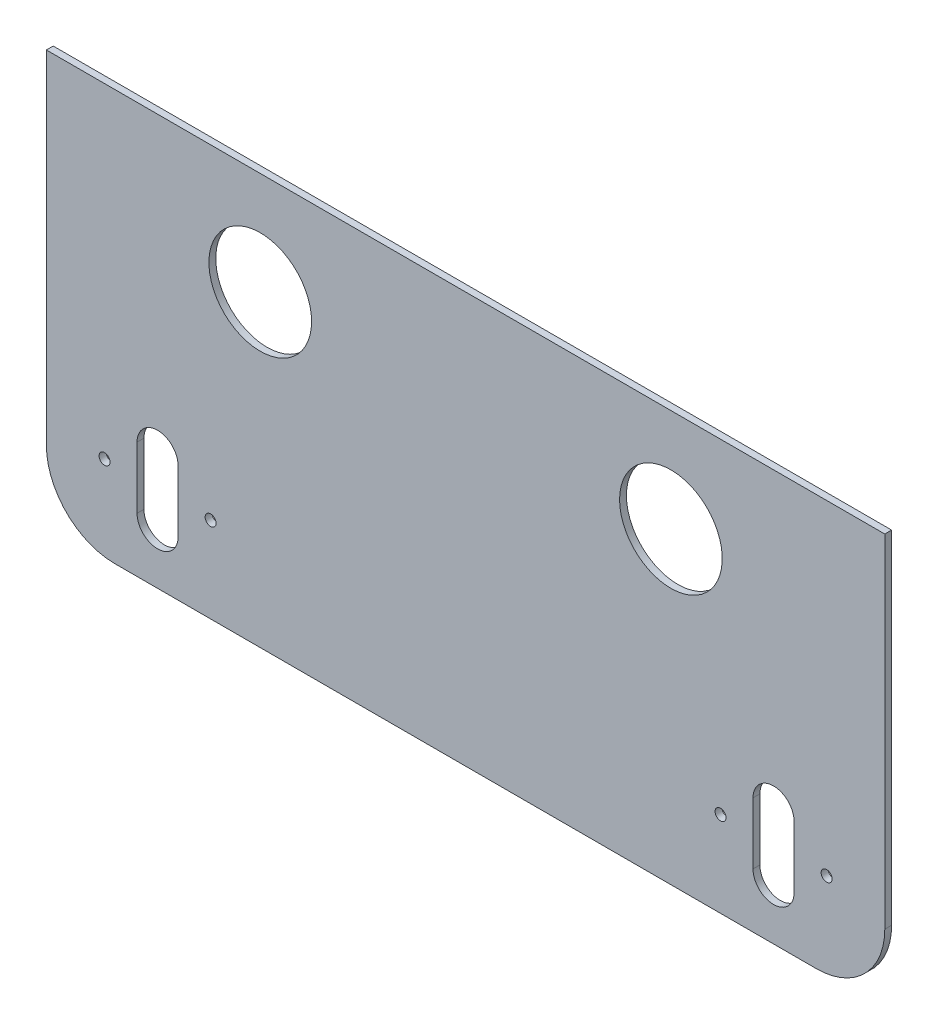
ISO-10303-21;
HEADER;
FILE_DESCRIPTION(('STEP AP214'),'2;1');
FILE_NAME('part.step','',(''),(''),'','','');
FILE_SCHEMA(('AUTOMOTIVE_DESIGN { 1 0 10303 214 1 1 1 1 }'));
ENDSEC;
DATA;
#1=APPLICATION_CONTEXT('core data for automotive mechanical design processes');
#2=APPLICATION_PROTOCOL_DEFINITION('international standard','automotive_design',2000,#1);
#3=PRODUCT_CONTEXT('',#1,'mechanical');
#4=PRODUCT('Part','Part','',(#3));
#5=PRODUCT_RELATED_PRODUCT_CATEGORY('part','',(#4));
#6=PRODUCT_DEFINITION_FORMATION('','',#4);
#7=PRODUCT_DEFINITION_CONTEXT('part definition',#1,'design');
#8=PRODUCT_DEFINITION('design','',#6,#7);
#9=PRODUCT_DEFINITION_SHAPE('','',#8);
#10=(LENGTH_UNIT() NAMED_UNIT(*) SI_UNIT(.MILLI.,.METRE.));
#11=(NAMED_UNIT(*) PLANE_ANGLE_UNIT() SI_UNIT($,.RADIAN.));
#12=(NAMED_UNIT(*) SI_UNIT($,.STERADIAN.) SOLID_ANGLE_UNIT());
#13=UNCERTAINTY_MEASURE_WITH_UNIT(LENGTH_MEASURE(1.E-05),#10,'distance_accuracy_value','');
#14=(GEOMETRIC_REPRESENTATION_CONTEXT(3) GLOBAL_UNCERTAINTY_ASSIGNED_CONTEXT((#13)) GLOBAL_UNIT_ASSIGNED_CONTEXT((#10,
#11,#12)) REPRESENTATION_CONTEXT('',''));
#15=CARTESIAN_POINT('',(0.,0.,0.));
#16=DIRECTION('',(0.,0.,1.));
#17=DIRECTION('',(1.,0.,0.));
#18=AXIS2_PLACEMENT_3D('',#15,#16,#17);
#19=CARTESIAN_POINT('',(0.,0.,2.));
#20=DIRECTION('',(0.,0.,1.));
#21=DIRECTION('',(1.,0.,0.));
#22=AXIS2_PLACEMENT_3D('',#19,#20,#21);
#23=PLANE('',#22);
#24=CARTESIAN_POINT('',(-41.7088974906264,-59.2936597760602,2.));
#25=DIRECTION('',(0.,0.,1.));
#26=DIRECTION('',(1.,0.,0.));
#27=AXIS2_PLACEMENT_3D('',#24,#25,#26);
#28=CIRCLE('',#27,5.99999999999997);
#29=CARTESIAN_POINT('',(-47.7088974906264,-59.2936597760602,2.));
#30=VERTEX_POINT('',#29);
#31=CARTESIAN_POINT('',(-35.7088974906264,-59.2936597760602,2.));
#32=VERTEX_POINT('',#31);
#33=EDGE_CURVE('E61',#30,#32,#28,.T.);
#34=ORIENTED_EDGE('',*,*,#33,.F.);
#35=DIRECTION('',(0.,-1.,0.));
#36=VECTOR('',#35,1.);
#37=CARTESIAN_POINT('',(-47.7088974906264,-59.2936597760602,2.));
#38=LINE('',#37,#36);
#39=CARTESIAN_POINT('',(-47.7088974906264,-41.2936597760602,2.));
#40=VERTEX_POINT('',#39);
#41=EDGE_CURVE('E190',#40,#30,#38,.T.);
#42=ORIENTED_EDGE('',*,*,#41,.F.);
#43=CARTESIAN_POINT('',(-41.7088974906264,-41.2936597760602,2.));
#44=DIRECTION('',(0.,0.,1.));
#45=DIRECTION('',(1.,0.,0.));
#46=AXIS2_PLACEMENT_3D('',#43,#44,#45);
#47=CIRCLE('',#46,5.99999999999997);
#48=CARTESIAN_POINT('',(-35.7088974906264,-41.2936597760602,2.));
#49=VERTEX_POINT('',#48);
#50=EDGE_CURVE('E199',#49,#40,#47,.T.);
#51=ORIENTED_EDGE('',*,*,#50,.F.);
#52=DIRECTION('',(0.,1.,0.));
#53=VECTOR('',#52,1.);
#54=CARTESIAN_POINT('',(-35.7088974906264,-59.2936597760602,2.));
#55=LINE('',#54,#53);
#56=EDGE_CURVE('E203',#32,#49,#55,.T.);
#57=ORIENTED_EDGE('',*,*,#56,.F.);
#58=EDGE_LOOP('',(#34,#42,#51,#57));
#59=FACE_BOUND('',#58,.T.);
#60=CARTESIAN_POINT('',(122.791102509374,-50.2936597760602,2.));
#61=DIRECTION('',(0.,0.,1.));
#62=DIRECTION('',(-1.,0.,0.));
#63=AXIS2_PLACEMENT_3D('',#60,#61,#62);
#64=CIRCLE('',#63,1.59999999999999);
#65=CARTESIAN_POINT('',(121.191102509374,-50.2936597760602,2.));
#66=VERTEX_POINT('',#65);
#67=EDGE_CURVE('E182',#66,#66,#64,.T.);
#68=ORIENTED_EDGE('',*,*,#67,.F.);
#69=EDGE_LOOP('',(#68));
#70=FACE_BOUND('',#69,.T.);
#71=CARTESIAN_POINT('',(153.791102509374,-50.2936597760602,2.));
#72=DIRECTION('',(0.,0.,1.));
#73=DIRECTION('',(-1.,0.,0.));
#74=AXIS2_PLACEMENT_3D('',#71,#72,#73);
#75=CIRCLE('',#74,1.59999999999999);
#76=CARTESIAN_POINT('',(152.191102509374,-50.2936597760602,2.));
#77=VERTEX_POINT('',#76);
#78=EDGE_CURVE('E186',#77,#77,#75,.T.);
#79=ORIENTED_EDGE('',*,*,#78,.F.);
#80=EDGE_LOOP('',(#79));
#81=FACE_BOUND('',#80,.T.);
#82=CARTESIAN_POINT('',(-57.2088974906264,-50.2936597760602,2.));
#83=DIRECTION('',(0.,0.,1.));
#84=DIRECTION('',(1.,0.,0.));
#85=AXIS2_PLACEMENT_3D('',#82,#83,#84);
#86=CIRCLE('',#85,1.60000000000001);
#87=CARTESIAN_POINT('',(-55.6088974906264,-50.2936597760602,2.));
#88=VERTEX_POINT('',#87);
#89=EDGE_CURVE('E209',#88,#88,#86,.T.);
#90=ORIENTED_EDGE('',*,*,#89,.F.);
#91=EDGE_LOOP('',(#90));
#92=FACE_BOUND('',#91,.T.);
#93=CARTESIAN_POINT('',(138.291102509374,-59.2936597760602,2.));
#94=DIRECTION('',(0.,0.,1.));
#95=DIRECTION('',(-1.,0.,0.));
#96=AXIS2_PLACEMENT_3D('',#93,#94,#95);
#97=CIRCLE('',#96,5.99999999999998);
#98=CARTESIAN_POINT('',(132.291102509374,-59.2936597760602,2.));
#99=VERTEX_POINT('',#98);
#100=CARTESIAN_POINT('',(144.291102509374,-59.2936597760602,2.));
#101=VERTEX_POINT('',#100);
#102=EDGE_CURVE('E69',#99,#101,#97,.T.);
#103=ORIENTED_EDGE('',*,*,#102,.F.);
#104=DIRECTION('',(0.,-1.,0.));
#105=VECTOR('',#104,1.);
#106=CARTESIAN_POINT('',(132.291102509374,-59.2936597760602,2.));
#107=LINE('',#106,#105);
#108=CARTESIAN_POINT('',(132.291102509374,-41.2936597760602,2.));
#109=VERTEX_POINT('',#108);
#110=EDGE_CURVE('E158',#109,#99,#107,.T.);
#111=ORIENTED_EDGE('',*,*,#110,.F.);
#112=CARTESIAN_POINT('',(138.291102509374,-41.2936597760602,2.));
#113=DIRECTION('',(0.,0.,1.));
#114=DIRECTION('',(-1.,0.,0.));
#115=AXIS2_PLACEMENT_3D('',#112,#113,#114);
#116=CIRCLE('',#115,5.99999999999998);
#117=CARTESIAN_POINT('',(144.291102509374,-41.2936597760602,2.));
#118=VERTEX_POINT('',#117);
#119=EDGE_CURVE('E165',#118,#109,#116,.T.);
#120=ORIENTED_EDGE('',*,*,#119,.F.);
#121=DIRECTION('',(0.,1.,0.));
#122=VECTOR('',#121,1.);
#123=CARTESIAN_POINT('',(144.291102509374,-59.2936597760602,2.));
#124=LINE('',#123,#122);
#125=EDGE_CURVE('E171',#101,#118,#124,.T.);
#126=ORIENTED_EDGE('',*,*,#125,.F.);
#127=EDGE_LOOP('',(#103,#111,#120,#126));
#128=FACE_BOUND('',#127,.T.);
#129=CARTESIAN_POINT('',(-26.2088974906264,-50.2936597760602,2.));
#130=DIRECTION('',(0.,0.,1.));
#131=DIRECTION('',(1.,0.,0.));
#132=AXIS2_PLACEMENT_3D('',#129,#130,#131);
#133=CIRCLE('',#132,1.6);
#134=CARTESIAN_POINT('',(-24.6088974906264,-50.2936597760602,2.));
#135=VERTEX_POINT('',#134);
#136=EDGE_CURVE('E213',#135,#135,#133,.T.);
#137=ORIENTED_EDGE('',*,*,#136,.F.);
#138=EDGE_LOOP('',(#137));
#139=FACE_BOUND('',#138,.T.);
#140=CARTESIAN_POINT('',(-11.7088974906264,14.7063402239398,2.));
#141=DIRECTION('',(0.,0.,1.));
#142=DIRECTION('',(1.,0.,0.));
#143=AXIS2_PLACEMENT_3D('',#140,#141,#142);
#144=CIRCLE('',#143,15.);
#145=CARTESIAN_POINT('',(3.29110250937359,14.7063402239398,2.));
#146=VERTEX_POINT('',#145);
#147=EDGE_CURVE('E231',#146,#146,#144,.T.);
#148=ORIENTED_EDGE('',*,*,#147,.F.);
#149=EDGE_LOOP('',(#148));
#150=FACE_BOUND('',#149,.T.);
#151=DIRECTION('',(0.,-1.,0.));
#152=VECTOR('',#151,1.);
#153=CARTESIAN_POINT('',(-74.2088974906264,44.7063402239398,2.));
#154=LINE('',#153,#152);
#155=CARTESIAN_POINT('',(-74.2088974906264,44.7063402239398,2.));
#156=VERTEX_POINT('',#155);
#157=CARTESIAN_POINT('',(-74.2088974906264,-55.2936597760602,2.));
#158=VERTEX_POINT('',#157);
#159=EDGE_CURVE('E239',#156,#158,#154,.T.);
#160=ORIENTED_EDGE('',*,*,#159,.T.);
#161=CARTESIAN_POINT('',(-54.2088974906264,-55.2936597760602,2.));
#162=DIRECTION('',(0.,0.,1.));
#163=DIRECTION('',(1.,0.,0.));
#164=AXIS2_PLACEMENT_3D('',#161,#162,#163);
#165=CIRCLE('',#164,20.);
#166=CARTESIAN_POINT('',(-54.2088974906264,-75.2936597760602,2.));
#167=VERTEX_POINT('',#166);
#168=EDGE_CURVE('E297',#158,#167,#165,.T.);
#169=ORIENTED_EDGE('',*,*,#168,.T.);
#170=DIRECTION('',(1.,0.,0.));
#171=VECTOR('',#170,1.);
#172=CARTESIAN_POINT('',(-74.2088974906264,-75.2936597760602,2.));
#173=LINE('',#172,#171);
#174=CARTESIAN_POINT('',(150.791102509374,-75.2936597760602,2.));
#175=VERTEX_POINT('',#174);
#176=EDGE_CURVE('E243',#167,#175,#173,.T.);
#177=ORIENTED_EDGE('',*,*,#176,.T.);
#178=CARTESIAN_POINT('',(150.791102509374,-55.2936597760602,2.));
#179=DIRECTION('',(0.,0.,1.));
#180=DIRECTION('',(1.,0.,0.));
#181=AXIS2_PLACEMENT_3D('',#178,#179,#180);
#182=CIRCLE('',#181,20.);
#183=CARTESIAN_POINT('',(170.791102509374,-55.2936597760602,2.));
#184=VERTEX_POINT('',#183);
#185=EDGE_CURVE('E284',#175,#184,#182,.T.);
#186=ORIENTED_EDGE('',*,*,#185,.T.);
#187=DIRECTION('',(0.,1.,0.));
#188=VECTOR('',#187,1.);
#189=CARTESIAN_POINT('',(170.791102509374,44.7063402239398,2.));
#190=LINE('',#189,#188);
#191=CARTESIAN_POINT('',(170.791102509374,44.7063402239398,2.));
#192=VERTEX_POINT('',#191);
#193=EDGE_CURVE('E247',#184,#192,#190,.T.);
#194=ORIENTED_EDGE('',*,*,#193,.T.);
#195=DIRECTION('',(-1.,0.,0.));
#196=VECTOR('',#195,1.);
#197=CARTESIAN_POINT('',(-74.2088974906264,44.7063402239398,2.));
#198=LINE('',#197,#196);
#199=EDGE_CURVE('E250',#192,#156,#198,.T.);
#200=ORIENTED_EDGE('',*,*,#199,.T.);
#201=EDGE_LOOP('',(#160,#169,#177,#186,#194,#200));
#202=FACE_BOUND('',#201,.T.);
#203=CARTESIAN_POINT('',(108.291102509374,14.7063402239398,2.));
#204=DIRECTION('',(0.,0.,1.));
#205=DIRECTION('',(-1.,0.,0.));
#206=AXIS2_PLACEMENT_3D('',#203,#204,#205);
#207=CIRCLE('',#206,15.);
#208=CARTESIAN_POINT('',(93.2911025093736,14.7063402239398,2.));
#209=VERTEX_POINT('',#208);
#210=EDGE_CURVE('E221',#209,#209,#207,.T.);
#211=ORIENTED_EDGE('',*,*,#210,.F.);
#212=EDGE_LOOP('',(#211));
#213=FACE_BOUND('',#212,.T.);
#214=ADVANCED_FACE('F45',(#59,#70,#81,#92,#128,#139,#150,#202,#213),#23,.T.);
#215=CARTESIAN_POINT('',(0.,0.,0.));
#216=DIRECTION('',(0.,0.,1.));
#217=DIRECTION('',(1.,0.,0.));
#218=AXIS2_PLACEMENT_3D('',#215,#216,#217);
#219=PLANE('',#218);
#220=DIRECTION('',(0.,-1.,0.));
#221=VECTOR('',#220,1.);
#222=CARTESIAN_POINT('',(-47.7088974906264,0.,0.));
#223=LINE('',#222,#221);
#224=CARTESIAN_POINT('',(-47.7088974906264,-41.2936597760602,0.));
#225=VERTEX_POINT('',#224);
#226=CARTESIAN_POINT('',(-47.7088974906264,-59.2936597760602,0.));
#227=VERTEX_POINT('',#226);
#228=EDGE_CURVE('E54',#225,#227,#223,.T.);
#229=ORIENTED_EDGE('',*,*,#228,.T.);
#230=CARTESIAN_POINT('',(-41.7088974906264,-59.2936597760602,0.));
#231=DIRECTION('',(0.,0.,1.));
#232=DIRECTION('',(1.,0.,0.));
#233=AXIS2_PLACEMENT_3D('',#230,#231,#232);
#234=CIRCLE('',#233,5.99999999999997);
#235=CARTESIAN_POINT('',(-35.7088974906264,-59.2936597760602,0.));
#236=VERTEX_POINT('',#235);
#237=EDGE_CURVE('E11',#227,#236,#234,.T.);
#238=ORIENTED_EDGE('',*,*,#237,.T.);
#239=DIRECTION('',(0.,1.,0.));
#240=VECTOR('',#239,1.);
#241=CARTESIAN_POINT('',(-35.7088974906264,0.,0.));
#242=LINE('',#241,#240);
#243=CARTESIAN_POINT('',(-35.7088974906264,-41.2936597760602,0.));
#244=VERTEX_POINT('',#243);
#245=EDGE_CURVE('E317',#236,#244,#242,.T.);
#246=ORIENTED_EDGE('',*,*,#245,.T.);
#247=CARTESIAN_POINT('',(-41.7088974906264,-41.2936597760602,0.));
#248=DIRECTION('',(0.,0.,1.));
#249=DIRECTION('',(1.,0.,0.));
#250=AXIS2_PLACEMENT_3D('',#247,#248,#249);
#251=CIRCLE('',#250,5.99999999999997);
#252=EDGE_CURVE('E331',#244,#225,#251,.T.);
#253=ORIENTED_EDGE('',*,*,#252,.T.);
#254=EDGE_LOOP('',(#229,#238,#246,#253));
#255=FACE_BOUND('',#254,.T.);
#256=CARTESIAN_POINT('',(122.791102509374,-50.2936597760602,0.));
#257=DIRECTION('',(0.,0.,1.));
#258=DIRECTION('',(1.,0.,0.));
#259=AXIS2_PLACEMENT_3D('',#256,#257,#258);
#260=CIRCLE('',#259,1.59999999999999);
#261=CARTESIAN_POINT('',(124.391102509374,-50.2936597760602,0.));
#262=VERTEX_POINT('',#261);
#263=EDGE_CURVE('E230',#262,#262,#260,.T.);
#264=ORIENTED_EDGE('',*,*,#263,.T.);
#265=EDGE_LOOP('',(#264));
#266=FACE_BOUND('',#265,.T.);
#267=CARTESIAN_POINT('',(153.791102509374,-50.2936597760602,0.));
#268=DIRECTION('',(0.,0.,1.));
#269=DIRECTION('',(1.,0.,0.));
#270=AXIS2_PLACEMENT_3D('',#267,#268,#269);
#271=CIRCLE('',#270,1.59999999999999);
#272=CARTESIAN_POINT('',(155.391102509374,-50.2936597760602,0.));
#273=VERTEX_POINT('',#272);
#274=EDGE_CURVE('E321',#273,#273,#271,.T.);
#275=ORIENTED_EDGE('',*,*,#274,.T.);
#276=EDGE_LOOP('',(#275));
#277=FACE_BOUND('',#276,.T.);
#278=CARTESIAN_POINT('',(-57.2088974906264,-50.2936597760602,0.));
#279=DIRECTION('',(0.,0.,1.));
#280=DIRECTION('',(1.,0.,0.));
#281=AXIS2_PLACEMENT_3D('',#278,#279,#280);
#282=CIRCLE('',#281,1.60000000000001);
#283=CARTESIAN_POINT('',(-55.6088974906264,-50.2936597760602,0.));
#284=VERTEX_POINT('',#283);
#285=EDGE_CURVE('E304',#284,#284,#282,.T.);
#286=ORIENTED_EDGE('',*,*,#285,.T.);
#287=EDGE_LOOP('',(#286));
#288=FACE_BOUND('',#287,.T.);
#289=DIRECTION('',(0.,-1.,0.));
#290=VECTOR('',#289,1.);
#291=CARTESIAN_POINT('',(132.291102509374,0.,0.));
#292=LINE('',#291,#290);
#293=CARTESIAN_POINT('',(132.291102509374,-41.2936597760602,0.));
#294=VERTEX_POINT('',#293);
#295=CARTESIAN_POINT('',(132.291102509374,-59.2936597760602,0.));
#296=VERTEX_POINT('',#295);
#297=EDGE_CURVE('E312',#294,#296,#292,.T.);
#298=ORIENTED_EDGE('',*,*,#297,.T.);
#299=CARTESIAN_POINT('',(138.291102509374,-59.2936597760602,0.));
#300=DIRECTION('',(0.,0.,1.));
#301=DIRECTION('',(1.,0.,0.));
#302=AXIS2_PLACEMENT_3D('',#299,#300,#301);
#303=CIRCLE('',#302,5.99999999999998);
#304=CARTESIAN_POINT('',(144.291102509374,-59.2936597760602,0.));
#305=VERTEX_POINT('',#304);
#306=EDGE_CURVE('E151',#296,#305,#303,.T.);
#307=ORIENTED_EDGE('',*,*,#306,.T.);
#308=DIRECTION('',(0.,1.,0.));
#309=VECTOR('',#308,1.);
#310=CARTESIAN_POINT('',(144.291102509374,0.,0.));
#311=LINE('',#310,#309);
#312=CARTESIAN_POINT('',(144.291102509374,-41.2936597760602,0.));
#313=VERTEX_POINT('',#312);
#314=EDGE_CURVE('E300',#305,#313,#311,.T.);
#315=ORIENTED_EDGE('',*,*,#314,.T.);
#316=CARTESIAN_POINT('',(138.291102509374,-41.2936597760602,0.));
#317=DIRECTION('',(0.,0.,1.));
#318=DIRECTION('',(1.,0.,0.));
#319=AXIS2_PLACEMENT_3D('',#316,#317,#318);
#320=CIRCLE('',#319,5.99999999999998);
#321=EDGE_CURVE('E308',#313,#294,#320,.T.);
#322=ORIENTED_EDGE('',*,*,#321,.T.);
#323=EDGE_LOOP('',(#298,#307,#315,#322));
#324=FACE_BOUND('',#323,.T.);
#325=CARTESIAN_POINT('',(-26.2088974906264,-50.2936597760602,0.));
#326=DIRECTION('',(0.,0.,1.));
#327=DIRECTION('',(1.,0.,0.));
#328=AXIS2_PLACEMENT_3D('',#325,#326,#327);
#329=CIRCLE('',#328,1.6);
#330=CARTESIAN_POINT('',(-24.6088974906264,-50.2936597760602,0.));
#331=VERTEX_POINT('',#330);
#332=EDGE_CURVE('E220',#331,#331,#329,.T.);
#333=ORIENTED_EDGE('',*,*,#332,.T.);
#334=EDGE_LOOP('',(#333));
#335=FACE_BOUND('',#334,.T.);
#336=DIRECTION('',(1.,0.,0.));
#337=VECTOR('',#336,1.);
#338=CARTESIAN_POINT('',(-74.2088974906264,-75.2936597760602,0.));
#339=LINE('',#338,#337);
#340=CARTESIAN_POINT('',(-54.2088974906264,-75.2936597760602,0.));
#341=VERTEX_POINT('',#340);
#342=CARTESIAN_POINT('',(150.791102509374,-75.2936597760602,0.));
#343=VERTEX_POINT('',#342);
#344=EDGE_CURVE('E257',#341,#343,#339,.T.);
#345=ORIENTED_EDGE('',*,*,#344,.F.);
#346=CARTESIAN_POINT('',(-54.2088974906264,-55.2936597760602,0.));
#347=DIRECTION('',(0.,0.,1.));
#348=DIRECTION('',(1.,0.,0.));
#349=AXIS2_PLACEMENT_3D('',#346,#347,#348);
#350=CIRCLE('',#349,20.);
#351=CARTESIAN_POINT('',(-74.2088974906264,-55.2936597760602,0.));
#352=VERTEX_POINT('',#351);
#353=EDGE_CURVE('E291',#341,#352,#350,.F.);
#354=ORIENTED_EDGE('',*,*,#353,.T.);
#355=DIRECTION('',(0.,-1.,0.));
#356=VECTOR('',#355,1.);
#357=CARTESIAN_POINT('',(-74.2088974906264,44.7063402239398,0.));
#358=LINE('',#357,#356);
#359=CARTESIAN_POINT('',(-74.2088974906264,44.7063402239398,0.));
#360=VERTEX_POINT('',#359);
#361=EDGE_CURVE('E235',#360,#352,#358,.T.);
#362=ORIENTED_EDGE('',*,*,#361,.F.);
#363=DIRECTION('',(-1.,0.,0.));
#364=VECTOR('',#363,1.);
#365=CARTESIAN_POINT('',(-74.2088974906264,44.7063402239398,0.));
#366=LINE('',#365,#364);
#367=CARTESIAN_POINT('',(170.791102509374,44.7063402239398,0.));
#368=VERTEX_POINT('',#367);
#369=EDGE_CURVE('E244',#368,#360,#366,.T.);
#370=ORIENTED_EDGE('',*,*,#369,.F.);
#371=DIRECTION('',(0.,1.,0.));
#372=VECTOR('',#371,1.);
#373=CARTESIAN_POINT('',(170.791102509374,44.7063402239398,0.));
#374=LINE('',#373,#372);
#375=CARTESIAN_POINT('',(170.791102509374,-55.2936597760602,0.));
#376=VERTEX_POINT('',#375);
#377=EDGE_CURVE('E260',#376,#368,#374,.T.);
#378=ORIENTED_EDGE('',*,*,#377,.F.);
#379=CARTESIAN_POINT('',(150.791102509374,-55.2936597760602,0.));
#380=DIRECTION('',(0.,0.,1.));
#381=DIRECTION('',(1.,0.,0.));
#382=AXIS2_PLACEMENT_3D('',#379,#380,#381);
#383=CIRCLE('',#382,20.);
#384=EDGE_CURVE('E276',#376,#343,#383,.F.);
#385=ORIENTED_EDGE('',*,*,#384,.T.);
#386=EDGE_LOOP('',(#345,#354,#362,#370,#378,#385));
#387=FACE_BOUND('',#386,.T.);
#388=CARTESIAN_POINT('',(-11.7088974906264,14.7063402239398,0.));
#389=DIRECTION('',(0.,0.,1.));
#390=DIRECTION('',(1.,0.,0.));
#391=AXIS2_PLACEMENT_3D('',#388,#389,#390);
#392=CIRCLE('',#391,15.);
#393=CARTESIAN_POINT('',(3.29110250937359,14.7063402239398,0.));
#394=VERTEX_POINT('',#393);
#395=EDGE_CURVE('E225',#394,#394,#392,.T.);
#396=ORIENTED_EDGE('',*,*,#395,.T.);
#397=EDGE_LOOP('',(#396));
#398=FACE_BOUND('',#397,.T.);
#399=CARTESIAN_POINT('',(108.291102509374,14.7063402239398,0.));
#400=DIRECTION('',(0.,0.,1.));
#401=DIRECTION('',(-1.,0.,0.));
#402=AXIS2_PLACEMENT_3D('',#399,#400,#401);
#403=CIRCLE('',#402,15.);
#404=CARTESIAN_POINT('',(93.2911025093736,14.7063402239398,0.));
#405=VERTEX_POINT('',#404);
#406=EDGE_CURVE('E226',#405,#405,#403,.T.);
#407=ORIENTED_EDGE('',*,*,#406,.T.);
#408=EDGE_LOOP('',(#407));
#409=FACE_BOUND('',#408,.T.);
#410=ADVANCED_FACE('F337',(#255,#266,#277,#288,#324,#335,#387,#398,#409),#219,.F.);
#411=CARTESIAN_POINT('',(-74.2088974906264,44.7063402239398,2.));
#412=DIRECTION('',(1.,0.,0.));
#413=DIRECTION('',(0.,1.,0.));
#414=AXIS2_PLACEMENT_3D('',#411,#412,#413);
#415=PLANE('',#414);
#416=ORIENTED_EDGE('',*,*,#361,.T.);
#417=DIRECTION('',(0.,0.,-1.));
#418=VECTOR('',#417,1.);
#419=CARTESIAN_POINT('',(-74.2088974906264,-55.2936597760602,2.));
#420=LINE('',#419,#418);
#421=EDGE_CURVE('E294',#352,#158,#420,.F.);
#422=ORIENTED_EDGE('',*,*,#421,.T.);
#423=ORIENTED_EDGE('',*,*,#159,.F.);
#424=DIRECTION('',(0.,0.,-1.));
#425=VECTOR('',#424,1.);
#426=CARTESIAN_POINT('',(-74.2088974906264,44.7063402239398,2.));
#427=LINE('',#426,#425);
#428=EDGE_CURVE('E253',#156,#360,#427,.T.);
#429=ORIENTED_EDGE('',*,*,#428,.T.);
#430=EDGE_LOOP('',(#416,#422,#423,#429));
#431=FACE_BOUND('',#430,.T.);
#432=ADVANCED_FACE('F372',(#431),#415,.F.);
#433=CARTESIAN_POINT('',(-74.2088974906264,-75.2936597760602,2.));
#434=DIRECTION('',(0.,1.,0.));
#435=DIRECTION('',(-1.,0.,0.));
#436=AXIS2_PLACEMENT_3D('',#433,#434,#435);
#437=PLANE('',#436);
#438=ORIENTED_EDGE('',*,*,#176,.F.);
#439=DIRECTION('',(0.,0.,-1.));
#440=VECTOR('',#439,1.);
#441=CARTESIAN_POINT('',(-54.2088974906264,-75.2936597760602,2.));
#442=LINE('',#441,#440);
#443=EDGE_CURVE('E287',#167,#341,#442,.T.);
#444=ORIENTED_EDGE('',*,*,#443,.T.);
#445=ORIENTED_EDGE('',*,*,#344,.T.);
#446=DIRECTION('',(0.,0.,-1.));
#447=VECTOR('',#446,1.);
#448=CARTESIAN_POINT('',(150.791102509374,-75.2936597760602,2.));
#449=LINE('',#448,#447);
#450=EDGE_CURVE('E280',#343,#175,#449,.F.);
#451=ORIENTED_EDGE('',*,*,#450,.T.);
#452=EDGE_LOOP('',(#438,#444,#445,#451));
#453=FACE_BOUND('',#452,.T.);
#454=ADVANCED_FACE('F385',(#453),#437,.F.);
#455=CARTESIAN_POINT('',(170.791102509374,44.7063402239398,2.));
#456=DIRECTION('',(-1.,0.,0.));
#457=DIRECTION('',(0.,-1.,0.));
#458=AXIS2_PLACEMENT_3D('',#455,#456,#457);
#459=PLANE('',#458);
#460=ORIENTED_EDGE('',*,*,#193,.F.);
#461=DIRECTION('',(0.,0.,-1.));
#462=VECTOR('',#461,1.);
#463=CARTESIAN_POINT('',(170.791102509374,-55.2936597760602,2.));
#464=LINE('',#463,#462);
#465=EDGE_CURVE('E272',#184,#376,#464,.T.);
#466=ORIENTED_EDGE('',*,*,#465,.T.);
#467=ORIENTED_EDGE('',*,*,#377,.T.);
#468=DIRECTION('',(0.,0.,-1.));
#469=VECTOR('',#468,1.);
#470=CARTESIAN_POINT('',(170.791102509374,44.7063402239398,2.));
#471=LINE('',#470,#469);
#472=EDGE_CURVE('E268',#192,#368,#471,.T.);
#473=ORIENTED_EDGE('',*,*,#472,.F.);
#474=EDGE_LOOP('',(#460,#466,#467,#473));
#475=FACE_BOUND('',#474,.T.);
#476=ADVANCED_FACE('F381',(#475),#459,.F.);
#477=CARTESIAN_POINT('',(-74.2088974906264,44.7063402239398,2.));
#478=DIRECTION('',(0.,-1.,0.));
#479=DIRECTION('',(1.,0.,0.));
#480=AXIS2_PLACEMENT_3D('',#477,#478,#479);
#481=PLANE('',#480);
#482=ORIENTED_EDGE('',*,*,#369,.T.);
#483=ORIENTED_EDGE('',*,*,#428,.F.);
#484=ORIENTED_EDGE('',*,*,#199,.F.);
#485=ORIENTED_EDGE('',*,*,#472,.T.);
#486=EDGE_LOOP('',(#482,#483,#484,#485));
#487=FACE_BOUND('',#486,.T.);
#488=ADVANCED_FACE('F378',(#487),#481,.F.);
#489=CARTESIAN_POINT('',(-11.7088974906264,14.7063402239398,2.));
#490=DIRECTION('',(0.,0.,-1.));
#491=DIRECTION('',(-1.,0.,0.));
#492=AXIS2_PLACEMENT_3D('',#489,#490,#491);
#493=CYLINDRICAL_SURFACE('',#492,15.);
#494=ORIENTED_EDGE('',*,*,#147,.T.);
#495=EDGE_LOOP('',(#494));
#496=FACE_BOUND('',#495,.T.);
#497=ORIENTED_EDGE('',*,*,#395,.F.);
#498=EDGE_LOOP('',(#497));
#499=FACE_BOUND('',#498,.T.);
#500=ADVANCED_FACE('F375',(#496,#499),#493,.F.);
#501=CARTESIAN_POINT('',(108.291102509374,14.7063402239398,2.));
#502=DIRECTION('',(0.,0.,-1.));
#503=DIRECTION('',(-1.,0.,0.));
#504=AXIS2_PLACEMENT_3D('',#501,#502,#503);
#505=CYLINDRICAL_SURFACE('',#504,15.);
#506=ORIENTED_EDGE('',*,*,#210,.T.);
#507=EDGE_LOOP('',(#506));
#508=FACE_BOUND('',#507,.T.);
#509=ORIENTED_EDGE('',*,*,#406,.F.);
#510=EDGE_LOOP('',(#509));
#511=FACE_BOUND('',#510,.T.);
#512=ADVANCED_FACE('F394',(#508,#511),#505,.F.);
#513=CARTESIAN_POINT('',(150.791102509374,-55.2936597760602,2.));
#514=DIRECTION('',(0.,0.,-1.));
#515=DIRECTION('',(-1.,0.,0.));
#516=AXIS2_PLACEMENT_3D('',#513,#514,#515);
#517=CYLINDRICAL_SURFACE('',#516,20.);
#518=ORIENTED_EDGE('',*,*,#185,.F.);
#519=ORIENTED_EDGE('',*,*,#450,.F.);
#520=ORIENTED_EDGE('',*,*,#384,.F.);
#521=ORIENTED_EDGE('',*,*,#465,.F.);
#522=EDGE_LOOP('',(#518,#519,#520,#521));
#523=FACE_BOUND('',#522,.T.);
#524=ADVANCED_FACE('F392',(#523),#517,.T.);
#525=CARTESIAN_POINT('',(-54.2088974906264,-55.2936597760602,2.));
#526=DIRECTION('',(0.,0.,-1.));
#527=DIRECTION('',(-1.,0.,0.));
#528=AXIS2_PLACEMENT_3D('',#525,#526,#527);
#529=CYLINDRICAL_SURFACE('',#528,20.);
#530=ORIENTED_EDGE('',*,*,#168,.F.);
#531=ORIENTED_EDGE('',*,*,#421,.F.);
#532=ORIENTED_EDGE('',*,*,#353,.F.);
#533=ORIENTED_EDGE('',*,*,#443,.F.);
#534=EDGE_LOOP('',(#530,#531,#532,#533));
#535=FACE_BOUND('',#534,.T.);
#536=ADVANCED_FACE('F47',(#535),#529,.T.);
#537=CARTESIAN_POINT('',(-26.2088974906264,-50.2936597760602,-8.));
#538=DIRECTION('',(0.,0.,1.));
#539=DIRECTION('',(1.,0.,0.));
#540=AXIS2_PLACEMENT_3D('',#537,#538,#539);
#541=CYLINDRICAL_SURFACE('',#540,1.6);
#542=ORIENTED_EDGE('',*,*,#136,.T.);
#543=EDGE_LOOP('',(#542));
#544=FACE_BOUND('',#543,.T.);
#545=ORIENTED_EDGE('',*,*,#332,.F.);
#546=EDGE_LOOP('',(#545));
#547=FACE_BOUND('',#546,.T.);
#548=ADVANCED_FACE('F398',(#544,#547),#541,.F.);
#549=CARTESIAN_POINT('',(138.291102509374,-59.2936597760602,-8.));
#550=DIRECTION('',(0.,0.,1.));
#551=DIRECTION('',(1.,0.,0.));
#552=AXIS2_PLACEMENT_3D('',#549,#550,#551);
#553=CYLINDRICAL_SURFACE('',#552,5.99999999999998);
#554=DIRECTION('',(0.,0.,1.));
#555=VECTOR('',#554,1.);
#556=CARTESIAN_POINT('',(132.291102509374,-59.2936597760602,-8.));
#557=LINE('',#556,#555);
#558=EDGE_CURVE('E147',#296,#99,#557,.T.);
#559=ORIENTED_EDGE('',*,*,#558,.T.);
#560=ORIENTED_EDGE('',*,*,#102,.T.);
#561=DIRECTION('',(0.,0.,1.));
#562=VECTOR('',#561,1.);
#563=CARTESIAN_POINT('',(144.291102509374,-59.2936597760602,-8.));
#564=LINE('',#563,#562);
#565=EDGE_CURVE('E166',#305,#101,#564,.T.);
#566=ORIENTED_EDGE('',*,*,#565,.F.);
#567=ORIENTED_EDGE('',*,*,#306,.F.);
#568=EDGE_LOOP('',(#559,#560,#566,#567));
#569=FACE_BOUND('',#568,.T.);
#570=ADVANCED_FACE('F149',(#569),#553,.F.);
#571=CARTESIAN_POINT('',(132.291102509374,-59.2936597760602,-8.));
#572=DIRECTION('',(-1.,0.,0.));
#573=DIRECTION('',(0.,0.,1.));
#574=AXIS2_PLACEMENT_3D('',#571,#572,#573);
#575=PLANE('',#574);
#576=DIRECTION('',(0.,0.,1.));
#577=VECTOR('',#576,1.);
#578=CARTESIAN_POINT('',(132.291102509374,-41.2936597760602,-8.));
#579=LINE('',#578,#577);
#580=EDGE_CURVE('E155',#294,#109,#579,.T.);
#581=ORIENTED_EDGE('',*,*,#580,.T.);
#582=ORIENTED_EDGE('',*,*,#110,.T.);
#583=ORIENTED_EDGE('',*,*,#558,.F.);
#584=ORIENTED_EDGE('',*,*,#297,.F.);
#585=EDGE_LOOP('',(#581,#582,#583,#584));
#586=FACE_BOUND('',#585,.T.);
#587=ADVANCED_FACE('F159',(#586),#575,.F.);
#588=CARTESIAN_POINT('',(138.291102509374,-41.2936597760602,-8.));
#589=DIRECTION('',(0.,0.,1.));
#590=DIRECTION('',(1.,0.,0.));
#591=AXIS2_PLACEMENT_3D('',#588,#589,#590);
#592=CYLINDRICAL_SURFACE('',#591,5.99999999999998);
#593=DIRECTION('',(0.,0.,1.));
#594=VECTOR('',#593,1.);
#595=CARTESIAN_POINT('',(144.291102509374,-41.2936597760602,-8.));
#596=LINE('',#595,#594);
#597=EDGE_CURVE('E594',#313,#118,#596,.T.);
#598=ORIENTED_EDGE('',*,*,#597,.T.);
#599=ORIENTED_EDGE('',*,*,#119,.T.);
#600=ORIENTED_EDGE('',*,*,#580,.F.);
#601=ORIENTED_EDGE('',*,*,#321,.F.);
#602=EDGE_LOOP('',(#598,#599,#600,#601));
#603=FACE_BOUND('',#602,.T.);
#604=ADVANCED_FACE('F489',(#603),#592,.F.);
#605=CARTESIAN_POINT('',(144.291102509374,-59.2936597760602,-8.));
#606=DIRECTION('',(1.,0.,0.));
#607=DIRECTION('',(0.,0.,-1.));
#608=AXIS2_PLACEMENT_3D('',#605,#606,#607);
#609=PLANE('',#608);
#610=ORIENTED_EDGE('',*,*,#565,.T.);
#611=ORIENTED_EDGE('',*,*,#125,.T.);
#612=ORIENTED_EDGE('',*,*,#597,.F.);
#613=ORIENTED_EDGE('',*,*,#314,.F.);
#614=EDGE_LOOP('',(#610,#611,#612,#613));
#615=FACE_BOUND('',#614,.T.);
#616=ADVANCED_FACE('F497',(#615),#609,.F.);
#617=CARTESIAN_POINT('',(-57.2088974906264,-50.2936597760602,-8.));
#618=DIRECTION('',(0.,0.,1.));
#619=DIRECTION('',(1.,0.,0.));
#620=AXIS2_PLACEMENT_3D('',#617,#618,#619);
#621=CYLINDRICAL_SURFACE('',#620,1.60000000000001);
#622=ORIENTED_EDGE('',*,*,#89,.T.);
#623=EDGE_LOOP('',(#622));
#624=FACE_BOUND('',#623,.T.);
#625=ORIENTED_EDGE('',*,*,#285,.F.);
#626=EDGE_LOOP('',(#625));
#627=FACE_BOUND('',#626,.T.);
#628=ADVANCED_FACE('F506',(#624,#627),#621,.F.);
#629=CARTESIAN_POINT('',(153.791102509374,-50.2936597760602,-8.));
#630=DIRECTION('',(0.,0.,1.));
#631=DIRECTION('',(1.,0.,0.));
#632=AXIS2_PLACEMENT_3D('',#629,#630,#631);
#633=CYLINDRICAL_SURFACE('',#632,1.59999999999999);
#634=ORIENTED_EDGE('',*,*,#78,.T.);
#635=EDGE_LOOP('',(#634));
#636=FACE_BOUND('',#635,.T.);
#637=ORIENTED_EDGE('',*,*,#274,.F.);
#638=EDGE_LOOP('',(#637));
#639=FACE_BOUND('',#638,.T.);
#640=ADVANCED_FACE('F362',(#636,#639),#633,.F.);
#641=CARTESIAN_POINT('',(122.791102509374,-50.2936597760602,-8.));
#642=DIRECTION('',(0.,0.,1.));
#643=DIRECTION('',(1.,0.,0.));
#644=AXIS2_PLACEMENT_3D('',#641,#642,#643);
#645=CYLINDRICAL_SURFACE('',#644,1.59999999999999);
#646=ORIENTED_EDGE('',*,*,#67,.T.);
#647=EDGE_LOOP('',(#646));
#648=FACE_BOUND('',#647,.T.);
#649=ORIENTED_EDGE('',*,*,#263,.F.);
#650=EDGE_LOOP('',(#649));
#651=FACE_BOUND('',#650,.T.);
#652=ADVANCED_FACE('F355',(#648,#651),#645,.F.);
#653=CARTESIAN_POINT('',(-41.7088974906264,-59.2936597760602,-8.));
#654=DIRECTION('',(0.,0.,1.));
#655=DIRECTION('',(1.,0.,0.));
#656=AXIS2_PLACEMENT_3D('',#653,#654,#655);
#657=CYLINDRICAL_SURFACE('',#656,5.99999999999997);
#658=DIRECTION('',(0.,0.,1.));
#659=VECTOR('',#658,1.);
#660=CARTESIAN_POINT('',(-47.7088974906264,-59.2936597760602,-8.));
#661=LINE('',#660,#659);
#662=EDGE_CURVE('E173',#227,#30,#661,.T.);
#663=ORIENTED_EDGE('',*,*,#662,.T.);
#664=ORIENTED_EDGE('',*,*,#33,.T.);
#665=DIRECTION('',(0.,0.,1.));
#666=VECTOR('',#665,1.);
#667=CARTESIAN_POINT('',(-35.7088974906264,-59.2936597760602,-8.));
#668=LINE('',#667,#666);
#669=EDGE_CURVE('E187',#236,#32,#668,.T.);
#670=ORIENTED_EDGE('',*,*,#669,.F.);
#671=ORIENTED_EDGE('',*,*,#237,.F.);
#672=EDGE_LOOP('',(#663,#664,#670,#671));
#673=FACE_BOUND('',#672,.T.);
#674=ADVANCED_FACE('F353',(#673),#657,.F.);
#675=CARTESIAN_POINT('',(-47.7088974906264,-59.2936597760602,-8.));
#676=DIRECTION('',(-1.,0.,0.));
#677=DIRECTION('',(0.,0.,1.));
#678=AXIS2_PLACEMENT_3D('',#675,#676,#677);
#679=PLANE('',#678);
#680=DIRECTION('',(0.,0.,1.));
#681=VECTOR('',#680,1.);
#682=CARTESIAN_POINT('',(-47.7088974906264,-41.2936597760602,-8.));
#683=LINE('',#682,#681);
#684=EDGE_CURVE('E177',#225,#40,#683,.T.);
#685=ORIENTED_EDGE('',*,*,#684,.T.);
#686=ORIENTED_EDGE('',*,*,#41,.T.);
#687=ORIENTED_EDGE('',*,*,#662,.F.);
#688=ORIENTED_EDGE('',*,*,#228,.F.);
#689=EDGE_LOOP('',(#685,#686,#687,#688));
#690=FACE_BOUND('',#689,.T.);
#691=ADVANCED_FACE('F343',(#690),#679,.F.);
#692=CARTESIAN_POINT('',(-41.7088974906264,-41.2936597760602,-8.));
#693=DIRECTION('',(0.,0.,1.));
#694=DIRECTION('',(1.,0.,0.));
#695=AXIS2_PLACEMENT_3D('',#692,#693,#694);
#696=CYLINDRICAL_SURFACE('',#695,5.99999999999997);
#697=DIRECTION('',(0.,0.,1.));
#698=VECTOR('',#697,1.);
#699=CARTESIAN_POINT('',(-35.7088974906264,-41.2936597760602,-8.));
#700=LINE('',#699,#698);
#701=EDGE_CURVE('E191',#244,#49,#700,.T.);
#702=ORIENTED_EDGE('',*,*,#701,.T.);
#703=ORIENTED_EDGE('',*,*,#50,.T.);
#704=ORIENTED_EDGE('',*,*,#684,.F.);
#705=ORIENTED_EDGE('',*,*,#252,.F.);
#706=EDGE_LOOP('',(#702,#703,#704,#705));
#707=FACE_BOUND('',#706,.T.);
#708=ADVANCED_FACE('F345',(#707),#696,.F.);
#709=CARTESIAN_POINT('',(-35.7088974906264,-59.2936597760602,-8.));
#710=DIRECTION('',(1.,0.,0.));
#711=DIRECTION('',(0.,0.,-1.));
#712=AXIS2_PLACEMENT_3D('',#709,#710,#711);
#713=PLANE('',#712);
#714=ORIENTED_EDGE('',*,*,#669,.T.);
#715=ORIENTED_EDGE('',*,*,#56,.T.);
#716=ORIENTED_EDGE('',*,*,#701,.F.);
#717=ORIENTED_EDGE('',*,*,#245,.F.);
#718=EDGE_LOOP('',(#714,#715,#716,#717));
#719=FACE_BOUND('',#718,.T.);
#720=ADVANCED_FACE('F352',(#719),#713,.F.);
#721=CLOSED_SHELL('',(#214,#410,#432,#454,#476,#488,#500,#512,#524,#536,#548,#570,#587,#604,
#616,#628,#640,#652,#674,#691,#708,#720));
#722=MANIFOLD_SOLID_BREP('B2',#721);
#723=ADVANCED_BREP_SHAPE_REPRESENTATION('',(#18,#722),#14);
#724=SHAPE_DEFINITION_REPRESENTATION(#9,#723);
ENDSEC;
END-ISO-10303-21;
